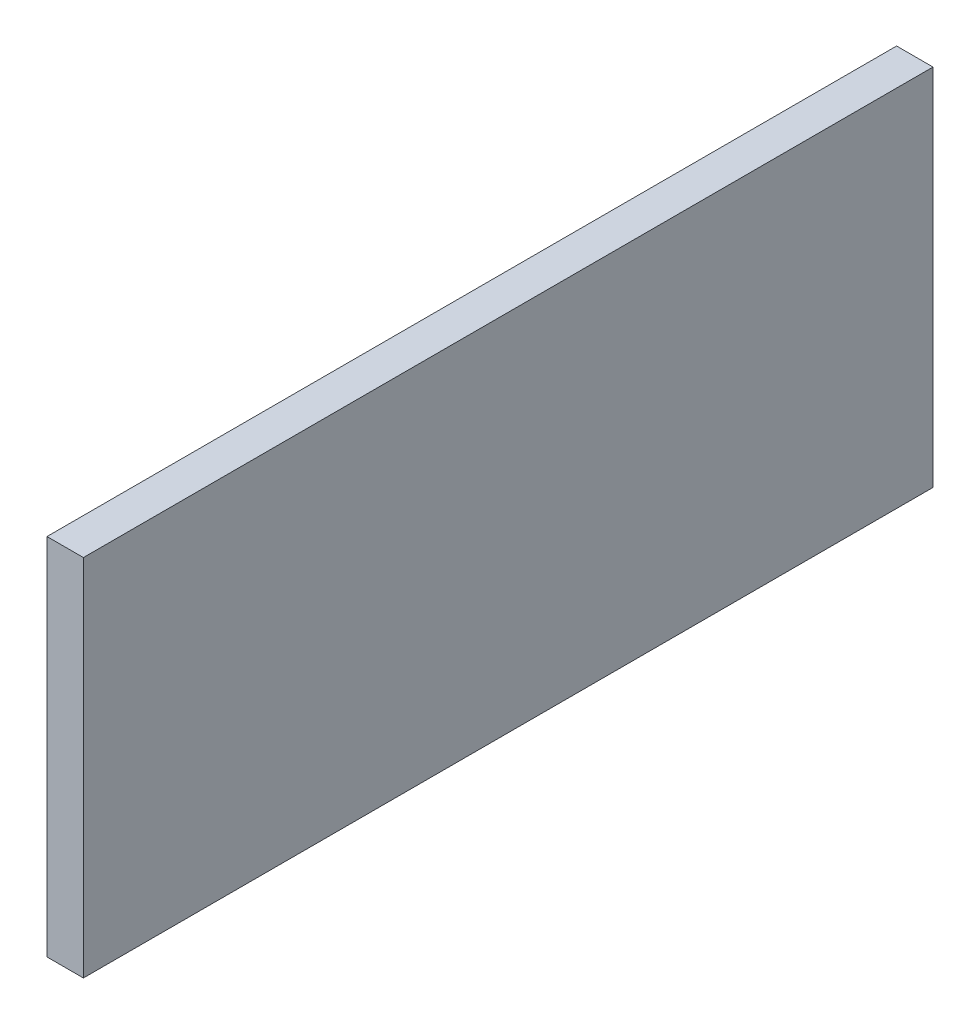
ISO-10303-21;
HEADER;
FILE_DESCRIPTION(('STEP AP214'),'2;1');
FILE_NAME('part.step','',(''),(''),'','','');
FILE_SCHEMA(('AUTOMOTIVE_DESIGN { 1 0 10303 214 1 1 1 1 }'));
ENDSEC;
DATA;
#1=APPLICATION_CONTEXT('core data for automotive mechanical design processes');
#2=APPLICATION_PROTOCOL_DEFINITION('international standard','automotive_design',2000,#1);
#3=PRODUCT_CONTEXT('',#1,'mechanical');
#4=PRODUCT('Part','Part','',(#3));
#5=PRODUCT_RELATED_PRODUCT_CATEGORY('part','',(#4));
#6=PRODUCT_DEFINITION_FORMATION('','',#4);
#7=PRODUCT_DEFINITION_CONTEXT('part definition',#1,'design');
#8=PRODUCT_DEFINITION('design','',#6,#7);
#9=PRODUCT_DEFINITION_SHAPE('','',#8);
#10=(LENGTH_UNIT() NAMED_UNIT(*) SI_UNIT(.MILLI.,.METRE.));
#11=(NAMED_UNIT(*) PLANE_ANGLE_UNIT() SI_UNIT($,.RADIAN.));
#12=(NAMED_UNIT(*) SI_UNIT($,.STERADIAN.) SOLID_ANGLE_UNIT());
#13=UNCERTAINTY_MEASURE_WITH_UNIT(LENGTH_MEASURE(1.E-05),#10,'distance_accuracy_value','');
#14=(GEOMETRIC_REPRESENTATION_CONTEXT(3) GLOBAL_UNCERTAINTY_ASSIGNED_CONTEXT((#13)) GLOBAL_UNIT_ASSIGNED_CONTEXT((#10,
#11,#12)) REPRESENTATION_CONTEXT('',''));
#15=CARTESIAN_POINT('',(0.,0.,0.));
#16=DIRECTION('',(0.,0.,1.));
#17=DIRECTION('',(1.,0.,0.));
#18=AXIS2_PLACEMENT_3D('',#15,#16,#17);
#19=CARTESIAN_POINT('',(3.,-15.,35.));
#20=DIRECTION('',(0.,0.,-1.));
#21=DIRECTION('',(-1.,0.,0.));
#22=AXIS2_PLACEMENT_3D('',#19,#20,#21);
#23=PLANE('',#22);
#24=DIRECTION('',(0.,-1.,0.));
#25=VECTOR('',#24,1.);
#26=CARTESIAN_POINT('',(0.,-15.,35.));
#27=LINE('',#26,#25);
#28=CARTESIAN_POINT('',(0.,15.,35.));
#29=VERTEX_POINT('',#28);
#30=CARTESIAN_POINT('',(0.,-15.,35.));
#31=VERTEX_POINT('',#30);
#32=EDGE_CURVE('E96',#29,#31,#27,.T.);
#33=ORIENTED_EDGE('',*,*,#32,.T.);
#34=DIRECTION('',(-1.,0.,0.));
#35=VECTOR('',#34,1.);
#36=CARTESIAN_POINT('',(3.,-15.,35.));
#37=LINE('',#36,#35);
#38=CARTESIAN_POINT('',(3.,-15.,35.));
#39=VERTEX_POINT('',#38);
#40=EDGE_CURVE('E11',#39,#31,#37,.T.);
#41=ORIENTED_EDGE('',*,*,#40,.F.);
#42=DIRECTION('',(0.,-1.,0.));
#43=VECTOR('',#42,1.);
#44=CARTESIAN_POINT('',(3.,-15.,35.));
#45=LINE('',#44,#43);
#46=CARTESIAN_POINT('',(3.,15.,35.));
#47=VERTEX_POINT('',#46);
#48=EDGE_CURVE('E84',#47,#39,#45,.T.);
#49=ORIENTED_EDGE('',*,*,#48,.F.);
#50=DIRECTION('',(-1.,0.,0.));
#51=VECTOR('',#50,1.);
#52=CARTESIAN_POINT('',(3.,15.,35.));
#53=LINE('',#52,#51);
#54=EDGE_CURVE('E92',#47,#29,#53,.T.);
#55=ORIENTED_EDGE('',*,*,#54,.T.);
#56=EDGE_LOOP('',(#33,#41,#49,#55));
#57=FACE_BOUND('',#56,.T.);
#58=ADVANCED_FACE('F33',(#57),#23,.F.);
#59=CARTESIAN_POINT('',(3.,-15.,-35.));
#60=DIRECTION('',(0.,1.,0.));
#61=DIRECTION('',(0.,0.,1.));
#62=AXIS2_PLACEMENT_3D('',#59,#60,#61);
#63=PLANE('',#62);
#64=DIRECTION('',(0.,0.,-1.));
#65=VECTOR('',#64,1.);
#66=CARTESIAN_POINT('',(0.,-15.,-35.));
#67=LINE('',#66,#65);
#68=CARTESIAN_POINT('',(0.,-15.,-35.));
#69=VERTEX_POINT('',#68);
#70=EDGE_CURVE('E88',#31,#69,#67,.T.);
#71=ORIENTED_EDGE('',*,*,#70,.T.);
#72=DIRECTION('',(-1.,0.,0.));
#73=VECTOR('',#72,1.);
#74=CARTESIAN_POINT('',(3.,-15.,-35.));
#75=LINE('',#74,#73);
#76=CARTESIAN_POINT('',(3.,-15.,-35.));
#77=VERTEX_POINT('',#76);
#78=EDGE_CURVE('E41',#77,#69,#75,.T.);
#79=ORIENTED_EDGE('',*,*,#78,.F.);
#80=DIRECTION('',(0.,0.,-1.));
#81=VECTOR('',#80,1.);
#82=CARTESIAN_POINT('',(3.,-15.,-35.));
#83=LINE('',#82,#81);
#84=EDGE_CURVE('E79',#39,#77,#83,.T.);
#85=ORIENTED_EDGE('',*,*,#84,.F.);
#86=ORIENTED_EDGE('',*,*,#40,.T.);
#87=EDGE_LOOP('',(#71,#79,#85,#86));
#88=FACE_BOUND('',#87,.T.);
#89=ADVANCED_FACE('F87',(#88),#63,.F.);
#90=CARTESIAN_POINT('',(3.,-15.,-35.));
#91=DIRECTION('',(0.,0.,1.));
#92=DIRECTION('',(1.,0.,0.));
#93=AXIS2_PLACEMENT_3D('',#90,#91,#92);
#94=PLANE('',#93);
#95=DIRECTION('',(0.,1.,0.));
#96=VECTOR('',#95,1.);
#97=CARTESIAN_POINT('',(0.,-15.,-35.));
#98=LINE('',#97,#96);
#99=CARTESIAN_POINT('',(0.,15.,-35.));
#100=VERTEX_POINT('',#99);
#101=EDGE_CURVE('E66',#69,#100,#98,.T.);
#102=ORIENTED_EDGE('',*,*,#101,.T.);
#103=DIRECTION('',(-1.,0.,0.));
#104=VECTOR('',#103,1.);
#105=CARTESIAN_POINT('',(3.,15.,-35.));
#106=LINE('',#105,#104);
#107=CARTESIAN_POINT('',(3.,15.,-35.));
#108=VERTEX_POINT('',#107);
#109=EDGE_CURVE('E89',#108,#100,#106,.T.);
#110=ORIENTED_EDGE('',*,*,#109,.F.);
#111=DIRECTION('',(0.,1.,0.));
#112=VECTOR('',#111,1.);
#113=CARTESIAN_POINT('',(3.,-15.,-35.));
#114=LINE('',#113,#112);
#115=EDGE_CURVE('E82',#77,#108,#114,.T.);
#116=ORIENTED_EDGE('',*,*,#115,.F.);
#117=ORIENTED_EDGE('',*,*,#78,.T.);
#118=EDGE_LOOP('',(#102,#110,#116,#117));
#119=FACE_BOUND('',#118,.T.);
#120=ADVANCED_FACE('F90',(#119),#94,.F.);
#121=CARTESIAN_POINT('',(3.,15.,-35.));
#122=DIRECTION('',(0.,-1.,0.));
#123=DIRECTION('',(0.,0.,-1.));
#124=AXIS2_PLACEMENT_3D('',#121,#122,#123);
#125=PLANE('',#124);
#126=DIRECTION('',(0.,0.,1.));
#127=VECTOR('',#126,1.);
#128=CARTESIAN_POINT('',(0.,15.,-35.));
#129=LINE('',#128,#127);
#130=EDGE_CURVE('E72',#100,#29,#129,.T.);
#131=ORIENTED_EDGE('',*,*,#130,.T.);
#132=ORIENTED_EDGE('',*,*,#54,.F.);
#133=DIRECTION('',(0.,0.,1.));
#134=VECTOR('',#133,1.);
#135=CARTESIAN_POINT('',(3.,15.,-35.));
#136=LINE('',#135,#134);
#137=EDGE_CURVE('E49',#108,#47,#136,.T.);
#138=ORIENTED_EDGE('',*,*,#137,.F.);
#139=ORIENTED_EDGE('',*,*,#109,.T.);
#140=EDGE_LOOP('',(#131,#132,#138,#139));
#141=FACE_BOUND('',#140,.T.);
#142=ADVANCED_FACE('F103',(#141),#125,.F.);
#143=CARTESIAN_POINT('',(3.,0.,0.));
#144=DIRECTION('',(1.,0.,0.));
#145=DIRECTION('',(0.,0.,-1.));
#146=AXIS2_PLACEMENT_3D('',#143,#144,#145);
#147=PLANE('',#146);
#148=ORIENTED_EDGE('',*,*,#48,.T.);
#149=ORIENTED_EDGE('',*,*,#84,.T.);
#150=ORIENTED_EDGE('',*,*,#115,.T.);
#151=ORIENTED_EDGE('',*,*,#137,.T.);
#152=EDGE_LOOP('',(#148,#149,#150,#151));
#153=FACE_BOUND('',#152,.T.);
#154=ADVANCED_FACE('F80',(#153),#147,.T.);
#155=CARTESIAN_POINT('',(0.,0.,0.));
#156=DIRECTION('',(1.,0.,0.));
#157=DIRECTION('',(0.,0.,-1.));
#158=AXIS2_PLACEMENT_3D('',#155,#156,#157);
#159=PLANE('',#158);
#160=ORIENTED_EDGE('',*,*,#32,.F.);
#161=ORIENTED_EDGE('',*,*,#130,.F.);
#162=ORIENTED_EDGE('',*,*,#101,.F.);
#163=ORIENTED_EDGE('',*,*,#70,.F.);
#164=EDGE_LOOP('',(#160,#161,#162,#163));
#165=FACE_BOUND('',#164,.T.);
#166=ADVANCED_FACE('F106',(#165),#159,.F.);
#167=CLOSED_SHELL('',(#58,#89,#120,#142,#154,#166));
#168=MANIFOLD_SOLID_BREP('B2',#167);
#169=ADVANCED_BREP_SHAPE_REPRESENTATION('',(#18,#168),#14);
#170=SHAPE_DEFINITION_REPRESENTATION(#9,#169);
ENDSEC;
END-ISO-10303-21;
